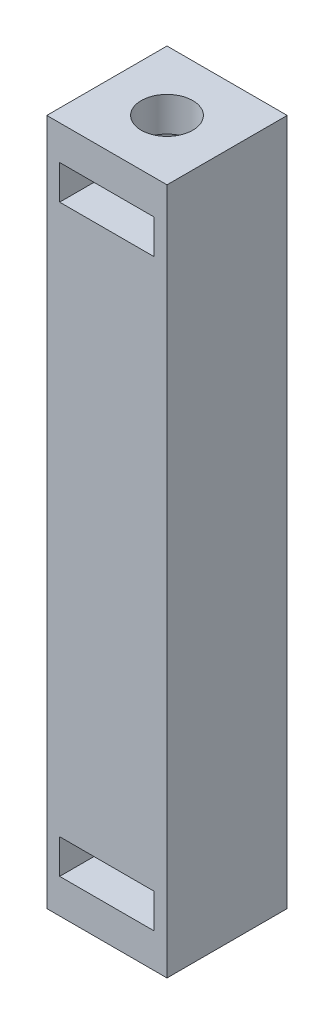
ISO-10303-21;
HEADER;
FILE_DESCRIPTION(('STEP AP214'),'2;1');
FILE_NAME('part.step','',(''),(''),'','','');
FILE_SCHEMA(('AUTOMOTIVE_DESIGN { 1 0 10303 214 1 1 1 1 }'));
ENDSEC;
DATA;
#1=APPLICATION_CONTEXT('core data for automotive mechanical design processes');
#2=APPLICATION_PROTOCOL_DEFINITION('international standard','automotive_design',2000,#1);
#3=PRODUCT_CONTEXT('',#1,'mechanical');
#4=PRODUCT('Part','Part','',(#3));
#5=PRODUCT_RELATED_PRODUCT_CATEGORY('part','',(#4));
#6=PRODUCT_DEFINITION_FORMATION('','',#4);
#7=PRODUCT_DEFINITION_CONTEXT('part definition',#1,'design');
#8=PRODUCT_DEFINITION('design','',#6,#7);
#9=PRODUCT_DEFINITION_SHAPE('','',#8);
#10=(LENGTH_UNIT() NAMED_UNIT(*) SI_UNIT(.MILLI.,.METRE.));
#11=(NAMED_UNIT(*) PLANE_ANGLE_UNIT() SI_UNIT($,.RADIAN.));
#12=(NAMED_UNIT(*) SI_UNIT($,.STERADIAN.) SOLID_ANGLE_UNIT());
#13=UNCERTAINTY_MEASURE_WITH_UNIT(LENGTH_MEASURE(1.E-05),#10,'distance_accuracy_value','');
#14=(GEOMETRIC_REPRESENTATION_CONTEXT(3) GLOBAL_UNCERTAINTY_ASSIGNED_CONTEXT((#13)) GLOBAL_UNIT_ASSIGNED_CONTEXT((#10,
#11,#12)) REPRESENTATION_CONTEXT('',''));
#15=CARTESIAN_POINT('',(0.,0.,0.));
#16=DIRECTION('',(0.,0.,1.));
#17=DIRECTION('',(1.,0.,0.));
#18=AXIS2_PLACEMENT_3D('',#15,#16,#17);
#19=CARTESIAN_POINT('',(0.,-1.,0.));
#20=DIRECTION('',(0.,1.,0.));
#21=DIRECTION('',(0.,0.,1.));
#22=AXIS2_PLACEMENT_3D('',#19,#20,#21);
#23=CYLINDRICAL_SURFACE('',#22,1.5);
#24=CARTESIAN_POINT('',(0.,38.,0.));
#25=DIRECTION('',(0.,1.,0.));
#26=DIRECTION('',(0.,0.,1.));
#27=AXIS2_PLACEMENT_3D('',#24,#25,#26);
#28=CIRCLE('',#27,1.5);
#29=CARTESIAN_POINT('',(0.,38.,1.5));
#30=VERTEX_POINT('',#29);
#31=EDGE_CURVE('E183',#30,#30,#28,.F.);
#32=ORIENTED_EDGE('',*,*,#31,.T.);
#33=EDGE_LOOP('',(#32));
#34=FACE_BOUND('',#33,.T.);
#35=CARTESIAN_POINT('',(0.,40.,0.));
#36=DIRECTION('',(0.,1.,0.));
#37=DIRECTION('',(0.,0.,1.));
#38=AXIS2_PLACEMENT_3D('',#35,#36,#37);
#39=CIRCLE('',#38,1.5);
#40=CARTESIAN_POINT('',(0.,40.,1.5));
#41=VERTEX_POINT('',#40);
#42=EDGE_CURVE('E199',#41,#41,#39,.T.);
#43=ORIENTED_EDGE('',*,*,#42,.T.);
#44=EDGE_LOOP('',(#43));
#45=FACE_BOUND('',#44,.T.);
#46=ADVANCED_FACE('F35',(#34,#45),#23,.F.);
#47=CARTESIAN_POINT('',(3.5,40.,-3.5));
#48=DIRECTION('',(-1.,0.,0.));
#49=DIRECTION('',(0.,0.,1.));
#50=AXIS2_PLACEMENT_3D('',#47,#48,#49);
#51=PLANE('',#50);
#52=DIRECTION('',(0.,0.,-1.));
#53=VECTOR('',#52,1.);
#54=CARTESIAN_POINT('',(3.5,0.,-3.5));
#55=LINE('',#54,#53);
#56=CARTESIAN_POINT('',(3.5,0.,3.5));
#57=VERTEX_POINT('',#56);
#58=CARTESIAN_POINT('',(3.5,0.,-3.5));
#59=VERTEX_POINT('',#58);
#60=EDGE_CURVE('E214',#57,#59,#55,.T.);
#61=ORIENTED_EDGE('',*,*,#60,.T.);
#62=DIRECTION('',(0.,-1.,0.));
#63=VECTOR('',#62,1.);
#64=CARTESIAN_POINT('',(3.5,40.,-3.5));
#65=LINE('',#64,#63);
#66=CARTESIAN_POINT('',(3.5,40.,-3.5));
#67=VERTEX_POINT('',#66);
#68=EDGE_CURVE('E11',#67,#59,#65,.T.);
#69=ORIENTED_EDGE('',*,*,#68,.F.);
#70=DIRECTION('',(0.,0.,-1.));
#71=VECTOR('',#70,1.);
#72=CARTESIAN_POINT('',(3.5,40.,-3.5));
#73=LINE('',#72,#71);
#74=CARTESIAN_POINT('',(3.5,40.,3.5));
#75=VERTEX_POINT('',#74);
#76=EDGE_CURVE('E203',#75,#67,#73,.T.);
#77=ORIENTED_EDGE('',*,*,#76,.F.);
#78=DIRECTION('',(0.,-1.,0.));
#79=VECTOR('',#78,1.);
#80=CARTESIAN_POINT('',(3.5,40.,3.5));
#81=LINE('',#80,#79);
#82=EDGE_CURVE('E213',#75,#57,#81,.T.);
#83=ORIENTED_EDGE('',*,*,#82,.T.);
#84=EDGE_LOOP('',(#61,#69,#77,#83));
#85=FACE_BOUND('',#84,.T.);
#86=ADVANCED_FACE('F37',(#85),#51,.F.);
#87=CARTESIAN_POINT('',(-3.5,40.,-3.5));
#88=DIRECTION('',(0.,0.,1.));
#89=DIRECTION('',(1.,0.,0.));
#90=AXIS2_PLACEMENT_3D('',#87,#88,#89);
#91=PLANE('',#90);
#92=DIRECTION('',(1.,0.,0.));
#93=VECTOR('',#92,1.);
#94=CARTESIAN_POINT('',(-3.5,36.,-3.5));
#95=LINE('',#94,#93);
#96=CARTESIAN_POINT('',(-2.75000000000001,36.,-3.5));
#97=VERTEX_POINT('',#96);
#98=CARTESIAN_POINT('',(2.74999999999999,36.,-3.5));
#99=VERTEX_POINT('',#98);
#100=EDGE_CURVE('E186',#97,#99,#95,.T.);
#101=ORIENTED_EDGE('',*,*,#100,.T.);
#102=DIRECTION('',(0.,1.,0.));
#103=VECTOR('',#102,1.);
#104=CARTESIAN_POINT('',(2.74999999999999,40.,-3.5));
#105=LINE('',#104,#103);
#106=CARTESIAN_POINT('',(2.74999999999999,38.,-3.5));
#107=VERTEX_POINT('',#106);
#108=EDGE_CURVE('E196',#99,#107,#105,.T.);
#109=ORIENTED_EDGE('',*,*,#108,.T.);
#110=DIRECTION('',(-1.,0.,0.));
#111=VECTOR('',#110,1.);
#112=CARTESIAN_POINT('',(-3.5,38.,-3.5));
#113=LINE('',#112,#111);
#114=CARTESIAN_POINT('',(-2.75000000000001,38.,-3.5));
#115=VERTEX_POINT('',#114);
#116=EDGE_CURVE('E184',#107,#115,#113,.T.);
#117=ORIENTED_EDGE('',*,*,#116,.T.);
#118=DIRECTION('',(0.,-1.,0.));
#119=VECTOR('',#118,1.);
#120=CARTESIAN_POINT('',(-2.75000000000001,40.,-3.5));
#121=LINE('',#120,#119);
#122=EDGE_CURVE('E131',#115,#97,#121,.T.);
#123=ORIENTED_EDGE('',*,*,#122,.T.);
#124=EDGE_LOOP('',(#101,#109,#117,#123));
#125=FACE_BOUND('',#124,.T.);
#126=DIRECTION('',(-1.,0.,0.));
#127=VECTOR('',#126,1.);
#128=CARTESIAN_POINT('',(-3.5,4.,-3.5));
#129=LINE('',#128,#127);
#130=CARTESIAN_POINT('',(2.74999999999999,4.,-3.5));
#131=VERTEX_POINT('',#130);
#132=CARTESIAN_POINT('',(-2.75000000000001,4.,-3.5));
#133=VERTEX_POINT('',#132);
#134=EDGE_CURVE('E180',#131,#133,#129,.T.);
#135=ORIENTED_EDGE('',*,*,#134,.T.);
#136=DIRECTION('',(0.,-1.,0.));
#137=VECTOR('',#136,1.);
#138=CARTESIAN_POINT('',(-2.75000000000001,40.,-3.5));
#139=LINE('',#138,#137);
#140=CARTESIAN_POINT('',(-2.75000000000001,2.,-3.5));
#141=VERTEX_POINT('',#140);
#142=EDGE_CURVE('E192',#133,#141,#139,.T.);
#143=ORIENTED_EDGE('',*,*,#142,.T.);
#144=DIRECTION('',(1.,0.,0.));
#145=VECTOR('',#144,1.);
#146=CARTESIAN_POINT('',(-3.5,2.,-3.5));
#147=LINE('',#146,#145);
#148=CARTESIAN_POINT('',(2.74999999999999,2.,-3.5));
#149=VERTEX_POINT('',#148);
#150=EDGE_CURVE('E176',#141,#149,#147,.T.);
#151=ORIENTED_EDGE('',*,*,#150,.T.);
#152=DIRECTION('',(0.,1.,0.));
#153=VECTOR('',#152,1.);
#154=CARTESIAN_POINT('',(2.74999999999999,40.,-3.5));
#155=LINE('',#154,#153);
#156=EDGE_CURVE('E189',#149,#131,#155,.T.);
#157=ORIENTED_EDGE('',*,*,#156,.T.);
#158=EDGE_LOOP('',(#135,#143,#151,#157));
#159=FACE_BOUND('',#158,.T.);
#160=DIRECTION('',(-1.,0.,0.));
#161=VECTOR('',#160,1.);
#162=CARTESIAN_POINT('',(-3.5,0.,-3.5));
#163=LINE('',#162,#161);
#164=CARTESIAN_POINT('',(-3.5,0.,-3.5));
#165=VERTEX_POINT('',#164);
#166=EDGE_CURVE('E217',#59,#165,#163,.T.);
#167=ORIENTED_EDGE('',*,*,#166,.T.);
#168=DIRECTION('',(0.,-1.,0.));
#169=VECTOR('',#168,1.);
#170=CARTESIAN_POINT('',(-3.5,40.,-3.5));
#171=LINE('',#170,#169);
#172=CARTESIAN_POINT('',(-3.5,40.,-3.5));
#173=VERTEX_POINT('',#172);
#174=EDGE_CURVE('E44',#173,#165,#171,.T.);
#175=ORIENTED_EDGE('',*,*,#174,.F.);
#176=DIRECTION('',(-1.,0.,0.));
#177=VECTOR('',#176,1.);
#178=CARTESIAN_POINT('',(-3.5,40.,-3.5));
#179=LINE('',#178,#177);
#180=EDGE_CURVE('E206',#67,#173,#179,.T.);
#181=ORIENTED_EDGE('',*,*,#180,.F.);
#182=ORIENTED_EDGE('',*,*,#68,.T.);
#183=EDGE_LOOP('',(#167,#175,#181,#182));
#184=FACE_BOUND('',#183,.T.);
#185=ADVANCED_FACE('F256',(#125,#159,#184),#91,.F.);
#186=CARTESIAN_POINT('',(-3.5,40.,-3.5));
#187=DIRECTION('',(1.,0.,0.));
#188=DIRECTION('',(0.,0.,-1.));
#189=AXIS2_PLACEMENT_3D('',#186,#187,#188);
#190=PLANE('',#189);
#191=DIRECTION('',(0.,0.,1.));
#192=VECTOR('',#191,1.);
#193=CARTESIAN_POINT('',(-3.5,0.,-3.5));
#194=LINE('',#193,#192);
#195=CARTESIAN_POINT('',(-3.5,0.,3.5));
#196=VERTEX_POINT('',#195);
#197=EDGE_CURVE('E219',#165,#196,#194,.T.);
#198=ORIENTED_EDGE('',*,*,#197,.T.);
#199=DIRECTION('',(0.,-1.,0.));
#200=VECTOR('',#199,1.);
#201=CARTESIAN_POINT('',(-3.5,40.,3.5));
#202=LINE('',#201,#200);
#203=CARTESIAN_POINT('',(-3.5,40.,3.5));
#204=VERTEX_POINT('',#203);
#205=EDGE_CURVE('E224',#204,#196,#202,.T.);
#206=ORIENTED_EDGE('',*,*,#205,.F.);
#207=DIRECTION('',(0.,0.,1.));
#208=VECTOR('',#207,1.);
#209=CARTESIAN_POINT('',(-3.5,40.,-3.5));
#210=LINE('',#209,#208);
#211=EDGE_CURVE('E209',#173,#204,#210,.T.);
#212=ORIENTED_EDGE('',*,*,#211,.F.);
#213=ORIENTED_EDGE('',*,*,#174,.T.);
#214=EDGE_LOOP('',(#198,#206,#212,#213));
#215=FACE_BOUND('',#214,.T.);
#216=ADVANCED_FACE('F298',(#215),#190,.F.);
#217=CARTESIAN_POINT('',(-3.5,40.,3.5));
#218=DIRECTION('',(0.,0.,-1.));
#219=DIRECTION('',(-1.,0.,0.));
#220=AXIS2_PLACEMENT_3D('',#217,#218,#219);
#221=PLANE('',#220);
#222=DIRECTION('',(-1.,0.,0.));
#223=VECTOR('',#222,1.);
#224=CARTESIAN_POINT('',(-2.75000000000001,38.,3.5));
#225=LINE('',#224,#223);
#226=CARTESIAN_POINT('',(2.74999999999999,38.,3.5));
#227=VERTEX_POINT('',#226);
#228=CARTESIAN_POINT('',(-2.75000000000001,38.,3.5));
#229=VERTEX_POINT('',#228);
#230=EDGE_CURVE('E138',#227,#229,#225,.T.);
#231=ORIENTED_EDGE('',*,*,#230,.F.);
#232=DIRECTION('',(0.,1.,0.));
#233=VECTOR('',#232,1.);
#234=CARTESIAN_POINT('',(2.74999999999999,36.,3.5));
#235=LINE('',#234,#233);
#236=CARTESIAN_POINT('',(2.74999999999999,36.,3.5));
#237=VERTEX_POINT('',#236);
#238=EDGE_CURVE('E143',#237,#227,#235,.T.);
#239=ORIENTED_EDGE('',*,*,#238,.F.);
#240=DIRECTION('',(1.,0.,0.));
#241=VECTOR('',#240,1.);
#242=CARTESIAN_POINT('',(-2.75000000000001,36.,3.5));
#243=LINE('',#242,#241);
#244=CARTESIAN_POINT('',(-2.75000000000001,36.,3.5));
#245=VERTEX_POINT('',#244);
#246=EDGE_CURVE('E148',#245,#237,#243,.T.);
#247=ORIENTED_EDGE('',*,*,#246,.F.);
#248=DIRECTION('',(0.,-1.,0.));
#249=VECTOR('',#248,1.);
#250=CARTESIAN_POINT('',(-2.75000000000001,36.,3.5));
#251=LINE('',#250,#249);
#252=EDGE_CURVE('E128',#229,#245,#251,.T.);
#253=ORIENTED_EDGE('',*,*,#252,.F.);
#254=EDGE_LOOP('',(#231,#239,#247,#253));
#255=FACE_BOUND('',#254,.T.);
#256=DIRECTION('',(1.,0.,0.));
#257=VECTOR('',#256,1.);
#258=CARTESIAN_POINT('',(-2.75000000000001,2.,3.5));
#259=LINE('',#258,#257);
#260=CARTESIAN_POINT('',(-2.75000000000001,2.,3.5));
#261=VERTEX_POINT('',#260);
#262=CARTESIAN_POINT('',(2.74999999999999,2.,3.5));
#263=VERTEX_POINT('',#262);
#264=EDGE_CURVE('E160',#261,#263,#259,.T.);
#265=ORIENTED_EDGE('',*,*,#264,.F.);
#266=DIRECTION('',(0.,-1.,0.));
#267=VECTOR('',#266,1.);
#268=CARTESIAN_POINT('',(-2.75000000000001,4.,3.5));
#269=LINE('',#268,#267);
#270=CARTESIAN_POINT('',(-2.75000000000001,4.,3.5));
#271=VERTEX_POINT('',#270);
#272=EDGE_CURVE('E158',#271,#261,#269,.T.);
#273=ORIENTED_EDGE('',*,*,#272,.F.);
#274=DIRECTION('',(-1.,0.,0.));
#275=VECTOR('',#274,1.);
#276=CARTESIAN_POINT('',(-2.75000000000001,4.,3.5));
#277=LINE('',#276,#275);
#278=CARTESIAN_POINT('',(2.74999999999999,4.,3.5));
#279=VERTEX_POINT('',#278);
#280=EDGE_CURVE('E165',#279,#271,#277,.T.);
#281=ORIENTED_EDGE('',*,*,#280,.F.);
#282=DIRECTION('',(0.,1.,0.));
#283=VECTOR('',#282,1.);
#284=CARTESIAN_POINT('',(2.74999999999999,4.,3.5));
#285=LINE('',#284,#283);
#286=EDGE_CURVE('E162',#263,#279,#285,.T.);
#287=ORIENTED_EDGE('',*,*,#286,.F.);
#288=EDGE_LOOP('',(#265,#273,#281,#287));
#289=FACE_BOUND('',#288,.T.);
#290=DIRECTION('',(1.,0.,0.));
#291=VECTOR('',#290,1.);
#292=CARTESIAN_POINT('',(-3.5,0.,3.5));
#293=LINE('',#292,#291);
#294=EDGE_CURVE('E207',#196,#57,#293,.T.);
#295=ORIENTED_EDGE('',*,*,#294,.T.);
#296=ORIENTED_EDGE('',*,*,#82,.F.);
#297=DIRECTION('',(1.,0.,0.));
#298=VECTOR('',#297,1.);
#299=CARTESIAN_POINT('',(-3.5,40.,3.5));
#300=LINE('',#299,#298);
#301=EDGE_CURVE('E211',#204,#75,#300,.T.);
#302=ORIENTED_EDGE('',*,*,#301,.F.);
#303=ORIENTED_EDGE('',*,*,#205,.T.);
#304=EDGE_LOOP('',(#295,#296,#302,#303));
#305=FACE_BOUND('',#304,.T.);
#306=ADVANCED_FACE('F145',(#255,#289,#305),#221,.F.);
#307=CARTESIAN_POINT('',(0.,40.,0.));
#308=DIRECTION('',(0.,1.,0.));
#309=DIRECTION('',(0.,0.,1.));
#310=AXIS2_PLACEMENT_3D('',#307,#308,#309);
#311=PLANE('',#310);
#312=ORIENTED_EDGE('',*,*,#42,.F.);
#313=EDGE_LOOP('',(#312));
#314=FACE_BOUND('',#313,.T.);
#315=ORIENTED_EDGE('',*,*,#76,.T.);
#316=ORIENTED_EDGE('',*,*,#180,.T.);
#317=ORIENTED_EDGE('',*,*,#211,.T.);
#318=ORIENTED_EDGE('',*,*,#301,.T.);
#319=EDGE_LOOP('',(#315,#316,#317,#318));
#320=FACE_BOUND('',#319,.T.);
#321=ADVANCED_FACE('F313',(#314,#320),#311,.T.);
#322=CARTESIAN_POINT('',(0.,0.,0.));
#323=DIRECTION('',(0.,1.,0.));
#324=DIRECTION('',(0.,0.,1.));
#325=AXIS2_PLACEMENT_3D('',#322,#323,#324);
#326=PLANE('',#325);
#327=CARTESIAN_POINT('',(0.,0.,0.));
#328=DIRECTION('',(0.,1.,0.));
#329=DIRECTION('',(0.,0.,1.));
#330=AXIS2_PLACEMENT_3D('',#327,#328,#329);
#331=CIRCLE('',#330,1.5);
#332=CARTESIAN_POINT('',(0.,0.,1.5));
#333=VERTEX_POINT('',#332);
#334=EDGE_CURVE('E202',#333,#333,#331,.T.);
#335=ORIENTED_EDGE('',*,*,#334,.T.);
#336=EDGE_LOOP('',(#335));
#337=FACE_BOUND('',#336,.T.);
#338=ORIENTED_EDGE('',*,*,#60,.F.);
#339=ORIENTED_EDGE('',*,*,#294,.F.);
#340=ORIENTED_EDGE('',*,*,#197,.F.);
#341=ORIENTED_EDGE('',*,*,#166,.F.);
#342=EDGE_LOOP('',(#338,#339,#340,#341));
#343=FACE_BOUND('',#342,.T.);
#344=ADVANCED_FACE('F262',(#337,#343),#326,.F.);
#345=CARTESIAN_POINT('',(0.,2.,0.));
#346=DIRECTION('',(0.,-1.,0.));
#347=DIRECTION('',(0.,0.,-1.));
#348=AXIS2_PLACEMENT_3D('',#345,#346,#347);
#349=CIRCLE('',#348,1.5);
#350=CARTESIAN_POINT('',(0.,2.,-1.5));
#351=VERTEX_POINT('',#350);
#352=EDGE_CURVE('E155',#351,#351,#349,.F.);
#353=ORIENTED_EDGE('',*,*,#352,.T.);
#354=EDGE_LOOP('',(#353));
#355=FACE_BOUND('',#354,.T.);
#356=ORIENTED_EDGE('',*,*,#334,.F.);
#357=EDGE_LOOP('',(#356));
#358=FACE_BOUND('',#357,.T.);
#359=ADVANCED_FACE('F251',(#355,#358),#23,.F.);
#360=CARTESIAN_POINT('',(-2.75000000000001,4.,-37.5));
#361=DIRECTION('',(-1.,0.,0.));
#362=DIRECTION('',(0.,0.,1.));
#363=AXIS2_PLACEMENT_3D('',#360,#361,#362);
#364=PLANE('',#363);
#365=DIRECTION('',(0.,0.,1.));
#366=VECTOR('',#365,1.);
#367=CARTESIAN_POINT('',(-2.75000000000001,4.,-37.5));
#368=LINE('',#367,#366);
#369=EDGE_CURVE('E169',#133,#271,#368,.T.);
#370=ORIENTED_EDGE('',*,*,#369,.T.);
#371=ORIENTED_EDGE('',*,*,#272,.T.);
#372=DIRECTION('',(0.,0.,1.));
#373=VECTOR('',#372,1.);
#374=CARTESIAN_POINT('',(-2.75000000000001,2.,-37.5));
#375=LINE('',#374,#373);
#376=EDGE_CURVE('E168',#141,#261,#375,.T.);
#377=ORIENTED_EDGE('',*,*,#376,.F.);
#378=ORIENTED_EDGE('',*,*,#142,.F.);
#379=EDGE_LOOP('',(#370,#371,#377,#378));
#380=FACE_BOUND('',#379,.T.);
#381=ADVANCED_FACE('F261',(#380),#364,.F.);
#382=CARTESIAN_POINT('',(2.74999999999999,4.,-37.5));
#383=DIRECTION('',(1.,0.,0.));
#384=DIRECTION('',(0.,0.,-1.));
#385=AXIS2_PLACEMENT_3D('',#382,#383,#384);
#386=PLANE('',#385);
#387=DIRECTION('',(0.,0.,1.));
#388=VECTOR('',#387,1.);
#389=CARTESIAN_POINT('',(2.74999999999999,2.,-37.5));
#390=LINE('',#389,#388);
#391=EDGE_CURVE('E60',#149,#263,#390,.T.);
#392=ORIENTED_EDGE('',*,*,#391,.T.);
#393=ORIENTED_EDGE('',*,*,#286,.T.);
#394=DIRECTION('',(0.,0.,1.));
#395=VECTOR('',#394,1.);
#396=CARTESIAN_POINT('',(2.74999999999999,4.,-37.5));
#397=LINE('',#396,#395);
#398=EDGE_CURVE('E171',#131,#279,#397,.T.);
#399=ORIENTED_EDGE('',*,*,#398,.F.);
#400=ORIENTED_EDGE('',*,*,#156,.F.);
#401=EDGE_LOOP('',(#392,#393,#399,#400));
#402=FACE_BOUND('',#401,.T.);
#403=ADVANCED_FACE('F283',(#402),#386,.F.);
#404=CARTESIAN_POINT('',(-2.75000000000001,4.,-37.5));
#405=DIRECTION('',(0.,1.,0.));
#406=DIRECTION('',(0.,0.,1.));
#407=AXIS2_PLACEMENT_3D('',#404,#405,#406);
#408=PLANE('',#407);
#409=CARTESIAN_POINT('',(0.,4.,0.));
#410=DIRECTION('',(0.,1.,0.));
#411=DIRECTION('',(0.,0.,1.));
#412=AXIS2_PLACEMENT_3D('',#409,#410,#411);
#413=CIRCLE('',#412,1.5);
#414=CARTESIAN_POINT('',(0.,4.,1.5));
#415=VERTEX_POINT('',#414);
#416=EDGE_CURVE('E179',#415,#415,#413,.F.);
#417=ORIENTED_EDGE('',*,*,#416,.F.);
#418=EDGE_LOOP('',(#417));
#419=FACE_BOUND('',#418,.T.);
#420=ORIENTED_EDGE('',*,*,#398,.T.);
#421=ORIENTED_EDGE('',*,*,#280,.T.);
#422=ORIENTED_EDGE('',*,*,#369,.F.);
#423=ORIENTED_EDGE('',*,*,#134,.F.);
#424=EDGE_LOOP('',(#420,#421,#422,#423));
#425=FACE_BOUND('',#424,.T.);
#426=ADVANCED_FACE('F273',(#419,#425),#408,.F.);
#427=CARTESIAN_POINT('',(-2.75000000000001,2.,-37.5));
#428=DIRECTION('',(0.,-1.,0.));
#429=DIRECTION('',(0.,0.,-1.));
#430=AXIS2_PLACEMENT_3D('',#427,#428,#429);
#431=PLANE('',#430);
#432=ORIENTED_EDGE('',*,*,#352,.F.);
#433=EDGE_LOOP('',(#432));
#434=FACE_BOUND('',#433,.T.);
#435=ORIENTED_EDGE('',*,*,#376,.T.);
#436=ORIENTED_EDGE('',*,*,#264,.T.);
#437=ORIENTED_EDGE('',*,*,#391,.F.);
#438=ORIENTED_EDGE('',*,*,#150,.F.);
#439=EDGE_LOOP('',(#435,#436,#437,#438));
#440=FACE_BOUND('',#439,.T.);
#441=ADVANCED_FACE('F266',(#434,#440),#431,.F.);
#442=CARTESIAN_POINT('',(0.,36.,0.));
#443=DIRECTION('',(0.,-1.,0.));
#444=DIRECTION('',(0.,0.,-1.));
#445=AXIS2_PLACEMENT_3D('',#442,#443,#444);
#446=CIRCLE('',#445,1.5);
#447=CARTESIAN_POINT('',(0.,36.,-1.5));
#448=VERTEX_POINT('',#447);
#449=EDGE_CURVE('E39',#448,#448,#446,.F.);
#450=ORIENTED_EDGE('',*,*,#449,.T.);
#451=EDGE_LOOP('',(#450));
#452=FACE_BOUND('',#451,.T.);
#453=ORIENTED_EDGE('',*,*,#416,.T.);
#454=EDGE_LOOP('',(#453));
#455=FACE_BOUND('',#454,.T.);
#456=ADVANCED_FACE('F252',(#452,#455),#23,.F.);
#457=CARTESIAN_POINT('',(2.74999999999999,36.,-37.5));
#458=DIRECTION('',(1.,0.,0.));
#459=DIRECTION('',(0.,0.,-1.));
#460=AXIS2_PLACEMENT_3D('',#457,#458,#459);
#461=PLANE('',#460);
#462=DIRECTION('',(0.,0.,1.));
#463=VECTOR('',#462,1.);
#464=CARTESIAN_POINT('',(2.74999999999999,36.,-37.5));
#465=LINE('',#464,#463);
#466=EDGE_CURVE('E153',#99,#237,#465,.T.);
#467=ORIENTED_EDGE('',*,*,#466,.T.);
#468=ORIENTED_EDGE('',*,*,#238,.T.);
#469=DIRECTION('',(0.,0.,1.));
#470=VECTOR('',#469,1.);
#471=CARTESIAN_POINT('',(2.74999999999999,38.,-37.5));
#472=LINE('',#471,#470);
#473=EDGE_CURVE('E134',#107,#227,#472,.T.);
#474=ORIENTED_EDGE('',*,*,#473,.F.);
#475=ORIENTED_EDGE('',*,*,#108,.F.);
#476=EDGE_LOOP('',(#467,#468,#474,#475));
#477=FACE_BOUND('',#476,.T.);
#478=ADVANCED_FACE('F265',(#477),#461,.F.);
#479=CARTESIAN_POINT('',(-2.75000000000001,36.,-37.5));
#480=DIRECTION('',(-1.,0.,0.));
#481=DIRECTION('',(0.,0.,1.));
#482=AXIS2_PLACEMENT_3D('',#479,#480,#481);
#483=PLANE('',#482);
#484=DIRECTION('',(0.,0.,1.));
#485=VECTOR('',#484,1.);
#486=CARTESIAN_POINT('',(-2.75000000000001,38.,-37.5));
#487=LINE('',#486,#485);
#488=EDGE_CURVE('E52',#115,#229,#487,.T.);
#489=ORIENTED_EDGE('',*,*,#488,.T.);
#490=ORIENTED_EDGE('',*,*,#252,.T.);
#491=DIRECTION('',(0.,0.,1.));
#492=VECTOR('',#491,1.);
#493=CARTESIAN_POINT('',(-2.75000000000001,36.,-37.5));
#494=LINE('',#493,#492);
#495=EDGE_CURVE('E133',#97,#245,#494,.T.);
#496=ORIENTED_EDGE('',*,*,#495,.F.);
#497=ORIENTED_EDGE('',*,*,#122,.F.);
#498=EDGE_LOOP('',(#489,#490,#496,#497));
#499=FACE_BOUND('',#498,.T.);
#500=ADVANCED_FACE('F125',(#499),#483,.F.);
#501=CARTESIAN_POINT('',(-2.75000000000001,36.,-37.5));
#502=DIRECTION('',(0.,-1.,0.));
#503=DIRECTION('',(0.,0.,-1.));
#504=AXIS2_PLACEMENT_3D('',#501,#502,#503);
#505=PLANE('',#504);
#506=ORIENTED_EDGE('',*,*,#449,.F.);
#507=EDGE_LOOP('',(#506));
#508=FACE_BOUND('',#507,.T.);
#509=ORIENTED_EDGE('',*,*,#495,.T.);
#510=ORIENTED_EDGE('',*,*,#246,.T.);
#511=ORIENTED_EDGE('',*,*,#466,.F.);
#512=ORIENTED_EDGE('',*,*,#100,.F.);
#513=EDGE_LOOP('',(#509,#510,#511,#512));
#514=FACE_BOUND('',#513,.T.);
#515=ADVANCED_FACE('F240',(#508,#514),#505,.F.);
#516=CARTESIAN_POINT('',(-2.75000000000001,38.,-37.5));
#517=DIRECTION('',(0.,1.,0.));
#518=DIRECTION('',(0.,0.,1.));
#519=AXIS2_PLACEMENT_3D('',#516,#517,#518);
#520=PLANE('',#519);
#521=ORIENTED_EDGE('',*,*,#31,.F.);
#522=EDGE_LOOP('',(#521));
#523=FACE_BOUND('',#522,.T.);
#524=ORIENTED_EDGE('',*,*,#473,.T.);
#525=ORIENTED_EDGE('',*,*,#230,.T.);
#526=ORIENTED_EDGE('',*,*,#488,.F.);
#527=ORIENTED_EDGE('',*,*,#116,.F.);
#528=EDGE_LOOP('',(#524,#525,#526,#527));
#529=FACE_BOUND('',#528,.T.);
#530=ADVANCED_FACE('F139',(#523,#529),#520,.F.);
#531=CLOSED_SHELL('',(#46,#86,#185,#216,#306,#321,#344,#359,#381,#403,#426,#441,#456,#478,#500,
#515,#530));
#532=MANIFOLD_SOLID_BREP('B2',#531);
#533=ADVANCED_BREP_SHAPE_REPRESENTATION('',(#18,#532),#14);
#534=SHAPE_DEFINITION_REPRESENTATION(#9,#533);
ENDSEC;
END-ISO-10303-21;
